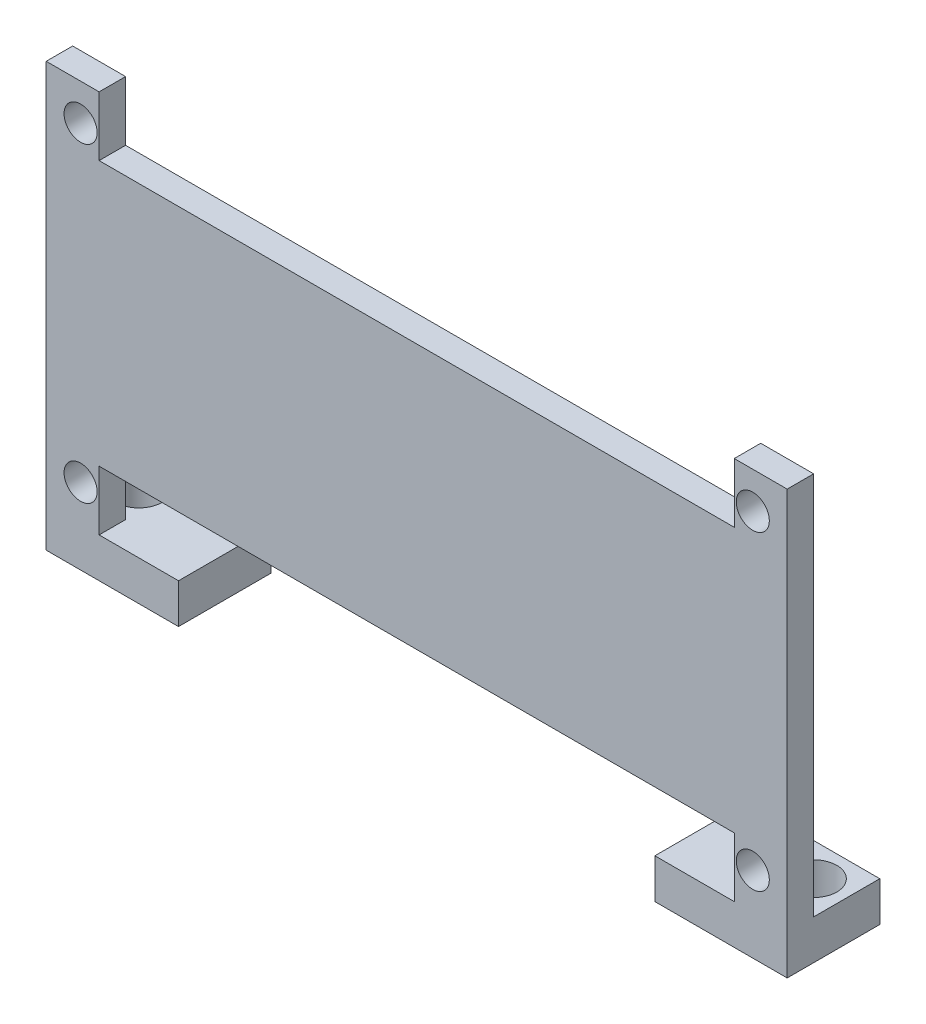
ISO-10303-21;
HEADER;
FILE_DESCRIPTION(('STEP AP214'),'2;1');
FILE_NAME('part.step','',(''),(''),'','','');
FILE_SCHEMA(('AUTOMOTIVE_DESIGN { 1 0 10303 214 1 1 1 1 }'));
ENDSEC;
DATA;
#1=APPLICATION_CONTEXT('core data for automotive mechanical design processes');
#2=APPLICATION_PROTOCOL_DEFINITION('international standard','automotive_design',2000,#1);
#3=PRODUCT_CONTEXT('',#1,'mechanical');
#4=PRODUCT('Part','Part','',(#3));
#5=PRODUCT_RELATED_PRODUCT_CATEGORY('part','',(#4));
#6=PRODUCT_DEFINITION_FORMATION('','',#4);
#7=PRODUCT_DEFINITION_CONTEXT('part definition',#1,'design');
#8=PRODUCT_DEFINITION('design','',#6,#7);
#9=PRODUCT_DEFINITION_SHAPE('','',#8);
#10=(LENGTH_UNIT() NAMED_UNIT(*) SI_UNIT(.MILLI.,.METRE.));
#11=(NAMED_UNIT(*) PLANE_ANGLE_UNIT() SI_UNIT($,.RADIAN.));
#12=(NAMED_UNIT(*) SI_UNIT($,.STERADIAN.) SOLID_ANGLE_UNIT());
#13=UNCERTAINTY_MEASURE_WITH_UNIT(LENGTH_MEASURE(1.E-05),#10,'distance_accuracy_value','');
#14=(GEOMETRIC_REPRESENTATION_CONTEXT(3) GLOBAL_UNCERTAINTY_ASSIGNED_CONTEXT((#13)) GLOBAL_UNIT_ASSIGNED_CONTEXT((#10,
#11,#12)) REPRESENTATION_CONTEXT('',''));
#15=CARTESIAN_POINT('',(0.,0.,0.));
#16=DIRECTION('',(0.,0.,1.));
#17=DIRECTION('',(1.,0.,0.));
#18=AXIS2_PLACEMENT_3D('',#15,#16,#17);
#19=CARTESIAN_POINT('',(-9.9656815453731,0.,2.));
#20=DIRECTION('',(1.,0.,0.));
#21=DIRECTION('',(0.,1.,0.));
#22=AXIS2_PLACEMENT_3D('',#19,#20,#21);
#23=PLANE('',#22);
#24=DIRECTION('',(0.,-1.,0.));
#25=VECTOR('',#24,1.);
#26=CARTESIAN_POINT('',(-9.9656815453731,0.,0.));
#27=LINE('',#26,#25);
#28=CARTESIAN_POINT('',(-9.96568154537309,-7.38239538892357,0.));
#29=VERTEX_POINT('',#28);
#30=CARTESIAN_POINT('',(-9.96568154537308,-11.8823953889236,0.));
#31=VERTEX_POINT('',#30);
#32=EDGE_CURVE('E186',#29,#31,#27,.T.);
#33=ORIENTED_EDGE('',*,*,#32,.F.);
#34=DIRECTION('',(0.,0.,-1.));
#35=VECTOR('',#34,1.);
#36=CARTESIAN_POINT('',(-9.96568154537309,-7.38239538892357,2.));
#37=LINE('',#36,#35);
#38=CARTESIAN_POINT('',(-9.96568154537309,-7.38239538892357,2.));
#39=VERTEX_POINT('',#38);
#40=EDGE_CURVE('E51',#39,#29,#37,.T.);
#41=ORIENTED_EDGE('',*,*,#40,.F.);
#42=DIRECTION('',(0.,-1.,0.));
#43=VECTOR('',#42,1.);
#44=CARTESIAN_POINT('',(-9.9656815453731,0.,2.));
#45=LINE('',#44,#43);
#46=CARTESIAN_POINT('',(-9.96568154537308,-11.8823953889236,2.));
#47=VERTEX_POINT('',#46);
#48=EDGE_CURVE('E365',#39,#47,#45,.T.);
#49=ORIENTED_EDGE('',*,*,#48,.T.);
#50=DIRECTION('',(0.,0.,-1.));
#51=VECTOR('',#50,1.);
#52=CARTESIAN_POINT('',(-9.96568154537308,-11.8823953889236,2.));
#53=LINE('',#52,#51);
#54=EDGE_CURVE('E11',#47,#31,#53,.T.);
#55=ORIENTED_EDGE('',*,*,#54,.T.);
#56=EDGE_LOOP('',(#33,#41,#49,#55));
#57=FACE_BOUND('',#56,.T.);
#58=ADVANCED_FACE('F40',(#57),#23,.T.);
#59=CARTESIAN_POINT('',(0.,-7.38239538892357,2.));
#60=DIRECTION('',(0.,1.,0.));
#61=DIRECTION('',(0.,0.,1.));
#62=AXIS2_PLACEMENT_3D('',#59,#60,#61);
#63=PLANE('',#62);
#64=DIRECTION('',(1.,0.,0.));
#65=VECTOR('',#64,1.);
#66=CARTESIAN_POINT('',(0.,-7.38239538892357,0.));
#67=LINE('',#66,#65);
#68=CARTESIAN_POINT('',(38.0343184546269,-7.38239538892357,0.));
#69=VERTEX_POINT('',#68);
#70=EDGE_CURVE('E190',#29,#69,#67,.T.);
#71=ORIENTED_EDGE('',*,*,#70,.T.);
#72=DIRECTION('',(0.,0.,-1.));
#73=VECTOR('',#72,1.);
#74=CARTESIAN_POINT('',(38.0343184546269,-7.38239538892357,2.));
#75=LINE('',#74,#73);
#76=CARTESIAN_POINT('',(38.0343184546269,-7.38239538892357,2.));
#77=VERTEX_POINT('',#76);
#78=EDGE_CURVE('E242',#77,#69,#75,.T.);
#79=ORIENTED_EDGE('',*,*,#78,.F.);
#80=DIRECTION('',(1.,0.,0.));
#81=VECTOR('',#80,1.);
#82=CARTESIAN_POINT('',(0.,-7.38239538892357,2.));
#83=LINE('',#82,#81);
#84=EDGE_CURVE('E368',#39,#77,#83,.T.);
#85=ORIENTED_EDGE('',*,*,#84,.F.);
#86=ORIENTED_EDGE('',*,*,#40,.T.);
#87=EDGE_LOOP('',(#71,#79,#85,#86));
#88=FACE_BOUND('',#87,.T.);
#89=ADVANCED_FACE('F423',(#88),#63,.F.);
#90=CARTESIAN_POINT('',(38.0343184546269,0.,2.));
#91=DIRECTION('',(1.,0.,0.));
#92=DIRECTION('',(0.,0.,-1.));
#93=AXIS2_PLACEMENT_3D('',#90,#91,#92);
#94=PLANE('',#93);
#95=DIRECTION('',(0.,-1.,0.));
#96=VECTOR('',#95,1.);
#97=CARTESIAN_POINT('',(38.0343184546269,0.,0.));
#98=LINE('',#97,#96);
#99=CARTESIAN_POINT('',(38.0343184546269,-11.8823953889236,0.));
#100=VERTEX_POINT('',#99);
#101=EDGE_CURVE('E194',#69,#100,#98,.T.);
#102=ORIENTED_EDGE('',*,*,#101,.T.);
#103=DIRECTION('',(0.,0.,-1.));
#104=VECTOR('',#103,1.);
#105=CARTESIAN_POINT('',(38.0343184546269,-11.8823953889236,2.));
#106=LINE('',#105,#104);
#107=CARTESIAN_POINT('',(38.0343184546269,-11.8823953889236,2.));
#108=VERTEX_POINT('',#107);
#109=EDGE_CURVE('E239',#108,#100,#106,.T.);
#110=ORIENTED_EDGE('',*,*,#109,.F.);
#111=DIRECTION('',(0.,-1.,0.));
#112=VECTOR('',#111,1.);
#113=CARTESIAN_POINT('',(38.0343184546269,0.,2.));
#114=LINE('',#113,#112);
#115=EDGE_CURVE('E372',#77,#108,#114,.T.);
#116=ORIENTED_EDGE('',*,*,#115,.F.);
#117=ORIENTED_EDGE('',*,*,#78,.T.);
#118=EDGE_LOOP('',(#102,#110,#116,#117));
#119=FACE_BOUND('',#118,.T.);
#120=ADVANCED_FACE('F431',(#119),#94,.F.);
#121=CARTESIAN_POINT('',(42.0343184546269,0.,2.));
#122=DIRECTION('',(-1.,0.,0.));
#123=DIRECTION('',(0.,0.,1.));
#124=AXIS2_PLACEMENT_3D('',#121,#122,#123);
#125=PLANE('',#124);
#126=DIRECTION('',(0.,1.,0.));
#127=VECTOR('',#126,1.);
#128=CARTESIAN_POINT('',(42.0343184546269,0.,0.));
#129=LINE('',#128,#127);
#130=CARTESIAN_POINT('',(42.0343184546269,-11.8823953889236,0.));
#131=VERTEX_POINT('',#130);
#132=CARTESIAN_POINT('',(42.0343184546269,17.1176046110764,0.));
#133=VERTEX_POINT('',#132);
#134=EDGE_CURVE('E202',#131,#133,#129,.T.);
#135=ORIENTED_EDGE('',*,*,#134,.T.);
#136=DIRECTION('',(0.,0.,-1.));
#137=VECTOR('',#136,1.);
#138=CARTESIAN_POINT('',(42.0343184546269,17.1176046110764,2.));
#139=LINE('',#138,#137);
#140=CARTESIAN_POINT('',(42.0343184546269,17.1176046110764,2.));
#141=VERTEX_POINT('',#140);
#142=EDGE_CURVE('E236',#141,#133,#139,.T.);
#143=ORIENTED_EDGE('',*,*,#142,.F.);
#144=DIRECTION('',(0.,1.,0.));
#145=VECTOR('',#144,1.);
#146=CARTESIAN_POINT('',(42.0343184546269,0.,2.));
#147=LINE('',#146,#145);
#148=CARTESIAN_POINT('',(42.0343184546269,-14.8823953889236,2.));
#149=VERTEX_POINT('',#148);
#150=EDGE_CURVE('E376',#149,#141,#147,.T.);
#151=ORIENTED_EDGE('',*,*,#150,.F.);
#152=DIRECTION('',(0.,0.,1.));
#153=VECTOR('',#152,1.);
#154=CARTESIAN_POINT('',(42.0343184546269,-14.8823953889236,-5.));
#155=LINE('',#154,#153);
#156=CARTESIAN_POINT('',(42.0343184546269,-14.8823953889236,-5.));
#157=VERTEX_POINT('',#156);
#158=EDGE_CURVE('E283',#157,#149,#155,.T.);
#159=ORIENTED_EDGE('',*,*,#158,.F.);
#160=DIRECTION('',(0.,1.,0.));
#161=VECTOR('',#160,1.);
#162=CARTESIAN_POINT('',(42.0343184546269,-11.8823953889236,-5.));
#163=LINE('',#162,#161);
#164=CARTESIAN_POINT('',(42.0343184546269,-11.8823953889236,-5.));
#165=VERTEX_POINT('',#164);
#166=EDGE_CURVE('E270',#157,#165,#163,.T.);
#167=ORIENTED_EDGE('',*,*,#166,.T.);
#168=DIRECTION('',(0.,0.,1.));
#169=VECTOR('',#168,1.);
#170=CARTESIAN_POINT('',(42.0343184546269,-11.8823953889236,-5.));
#171=LINE('',#170,#169);
#172=EDGE_CURVE('E303',#165,#131,#171,.T.);
#173=ORIENTED_EDGE('',*,*,#172,.T.);
#174=EDGE_LOOP('',(#135,#143,#151,#159,#167,#173));
#175=FACE_BOUND('',#174,.T.);
#176=ADVANCED_FACE('F536',(#175),#125,.F.);
#177=CARTESIAN_POINT('',(0.,17.1176046110764,2.));
#178=DIRECTION('',(0.,1.,0.));
#179=DIRECTION('',(0.,0.,1.));
#180=AXIS2_PLACEMENT_3D('',#177,#178,#179);
#181=PLANE('',#180);
#182=DIRECTION('',(1.,0.,0.));
#183=VECTOR('',#182,1.);
#184=CARTESIAN_POINT('',(0.,17.1176046110764,0.));
#185=LINE('',#184,#183);
#186=CARTESIAN_POINT('',(38.0343184546269,17.1176046110764,0.));
#187=VERTEX_POINT('',#186);
#188=EDGE_CURVE('E206',#187,#133,#185,.T.);
#189=ORIENTED_EDGE('',*,*,#188,.F.);
#190=DIRECTION('',(0.,0.,-1.));
#191=VECTOR('',#190,1.);
#192=CARTESIAN_POINT('',(38.0343184546269,17.1176046110764,2.));
#193=LINE('',#192,#191);
#194=CARTESIAN_POINT('',(38.0343184546269,17.1176046110764,2.));
#195=VERTEX_POINT('',#194);
#196=EDGE_CURVE('E233',#195,#187,#193,.T.);
#197=ORIENTED_EDGE('',*,*,#196,.F.);
#198=DIRECTION('',(1.,0.,0.));
#199=VECTOR('',#198,1.);
#200=CARTESIAN_POINT('',(0.,17.1176046110764,2.));
#201=LINE('',#200,#199);
#202=EDGE_CURVE('E157',#195,#141,#201,.T.);
#203=ORIENTED_EDGE('',*,*,#202,.T.);
#204=ORIENTED_EDGE('',*,*,#142,.T.);
#205=EDGE_LOOP('',(#189,#197,#203,#204));
#206=FACE_BOUND('',#205,.T.);
#207=ADVANCED_FACE('F382',(#206),#181,.T.);
#208=CARTESIAN_POINT('',(38.0343184546269,0.,2.));
#209=DIRECTION('',(-1.,0.,0.));
#210=DIRECTION('',(0.,-1.,0.));
#211=AXIS2_PLACEMENT_3D('',#208,#209,#210);
#212=PLANE('',#211);
#213=DIRECTION('',(0.,1.,0.));
#214=VECTOR('',#213,1.);
#215=CARTESIAN_POINT('',(38.0343184546269,0.,0.));
#216=LINE('',#215,#214);
#217=CARTESIAN_POINT('',(38.0343184546269,12.6176046110764,0.));
#218=VERTEX_POINT('',#217);
#219=EDGE_CURVE('E210',#218,#187,#216,.T.);
#220=ORIENTED_EDGE('',*,*,#219,.F.);
#221=DIRECTION('',(0.,0.,-1.));
#222=VECTOR('',#221,1.);
#223=CARTESIAN_POINT('',(38.0343184546269,12.6176046110764,2.));
#224=LINE('',#223,#222);
#225=CARTESIAN_POINT('',(38.0343184546269,12.6176046110764,2.));
#226=VERTEX_POINT('',#225);
#227=EDGE_CURVE('E137',#226,#218,#224,.T.);
#228=ORIENTED_EDGE('',*,*,#227,.F.);
#229=DIRECTION('',(0.,1.,0.));
#230=VECTOR('',#229,1.);
#231=CARTESIAN_POINT('',(38.0343184546269,0.,2.));
#232=LINE('',#231,#230);
#233=EDGE_CURVE('E153',#226,#195,#232,.T.);
#234=ORIENTED_EDGE('',*,*,#233,.T.);
#235=ORIENTED_EDGE('',*,*,#196,.T.);
#236=EDGE_LOOP('',(#220,#228,#234,#235));
#237=FACE_BOUND('',#236,.T.);
#238=ADVANCED_FACE('F387',(#237),#212,.T.);
#239=CARTESIAN_POINT('',(0.,12.6176046110764,2.));
#240=DIRECTION('',(0.,1.,0.));
#241=DIRECTION('',(0.,0.,1.));
#242=AXIS2_PLACEMENT_3D('',#239,#240,#241);
#243=PLANE('',#242);
#244=DIRECTION('',(1.,0.,0.));
#245=VECTOR('',#244,1.);
#246=CARTESIAN_POINT('',(0.,12.6176046110764,0.));
#247=LINE('',#246,#245);
#248=CARTESIAN_POINT('',(-9.96568154537309,12.6176046110764,0.));
#249=VERTEX_POINT('',#248);
#250=EDGE_CURVE('E132',#249,#218,#247,.T.);
#251=ORIENTED_EDGE('',*,*,#250,.F.);
#252=DIRECTION('',(0.,0.,-1.));
#253=VECTOR('',#252,1.);
#254=CARTESIAN_POINT('',(-9.96568154537309,12.6176046110764,2.));
#255=LINE('',#254,#253);
#256=CARTESIAN_POINT('',(-9.96568154537309,12.6176046110764,2.));
#257=VERTEX_POINT('',#256);
#258=EDGE_CURVE('E126',#257,#249,#255,.T.);
#259=ORIENTED_EDGE('',*,*,#258,.F.);
#260=DIRECTION('',(1.,0.,0.));
#261=VECTOR('',#260,1.);
#262=CARTESIAN_POINT('',(0.,12.6176046110764,2.));
#263=LINE('',#262,#261);
#264=EDGE_CURVE('E130',#257,#226,#263,.T.);
#265=ORIENTED_EDGE('',*,*,#264,.T.);
#266=ORIENTED_EDGE('',*,*,#227,.T.);
#267=EDGE_LOOP('',(#251,#259,#265,#266));
#268=FACE_BOUND('',#267,.T.);
#269=ADVANCED_FACE('F128',(#268),#243,.T.);
#270=CARTESIAN_POINT('',(-9.96568154537309,0.,2.));
#271=DIRECTION('',(-1.,0.,0.));
#272=DIRECTION('',(0.,0.,1.));
#273=AXIS2_PLACEMENT_3D('',#270,#271,#272);
#274=PLANE('',#273);
#275=DIRECTION('',(0.,1.,0.));
#276=VECTOR('',#275,1.);
#277=CARTESIAN_POINT('',(-9.96568154537309,0.,0.));
#278=LINE('',#277,#276);
#279=CARTESIAN_POINT('',(-9.96568154537309,17.1176046110764,0.));
#280=VERTEX_POINT('',#279);
#281=EDGE_CURVE('E216',#249,#280,#278,.T.);
#282=ORIENTED_EDGE('',*,*,#281,.T.);
#283=DIRECTION('',(0.,0.,-1.));
#284=VECTOR('',#283,1.);
#285=CARTESIAN_POINT('',(-9.96568154537309,17.1176046110764,2.));
#286=LINE('',#285,#284);
#287=CARTESIAN_POINT('',(-9.96568154537309,17.1176046110764,2.));
#288=VERTEX_POINT('',#287);
#289=EDGE_CURVE('E138',#288,#280,#286,.T.);
#290=ORIENTED_EDGE('',*,*,#289,.F.);
#291=DIRECTION('',(0.,1.,0.));
#292=VECTOR('',#291,1.);
#293=CARTESIAN_POINT('',(-9.96568154537309,0.,2.));
#294=LINE('',#293,#292);
#295=EDGE_CURVE('E141',#257,#288,#294,.T.);
#296=ORIENTED_EDGE('',*,*,#295,.F.);
#297=ORIENTED_EDGE('',*,*,#258,.T.);
#298=EDGE_LOOP('',(#282,#290,#296,#297));
#299=FACE_BOUND('',#298,.T.);
#300=ADVANCED_FACE('F142',(#299),#274,.F.);
#301=CARTESIAN_POINT('',(0.,17.1176046110764,2.));
#302=DIRECTION('',(0.,1.,0.));
#303=DIRECTION('',(0.,0.,1.));
#304=AXIS2_PLACEMENT_3D('',#301,#302,#303);
#305=PLANE('',#304);
#306=DIRECTION('',(1.,0.,0.));
#307=VECTOR('',#306,1.);
#308=CARTESIAN_POINT('',(0.,17.1176046110764,0.));
#309=LINE('',#308,#307);
#310=CARTESIAN_POINT('',(-13.9656815453731,17.1176046110764,0.));
#311=VERTEX_POINT('',#310);
#312=EDGE_CURVE('E219',#311,#280,#309,.T.);
#313=ORIENTED_EDGE('',*,*,#312,.F.);
#314=DIRECTION('',(0.,0.,-1.));
#315=VECTOR('',#314,1.);
#316=CARTESIAN_POINT('',(-13.9656815453731,17.1176046110764,2.));
#317=LINE('',#316,#315);
#318=CARTESIAN_POINT('',(-13.9656815453731,17.1176046110764,2.));
#319=VERTEX_POINT('',#318);
#320=EDGE_CURVE('E60',#319,#311,#317,.T.);
#321=ORIENTED_EDGE('',*,*,#320,.F.);
#322=DIRECTION('',(1.,0.,0.));
#323=VECTOR('',#322,1.);
#324=CARTESIAN_POINT('',(0.,17.1176046110764,2.));
#325=LINE('',#324,#323);
#326=EDGE_CURVE('E146',#319,#288,#325,.T.);
#327=ORIENTED_EDGE('',*,*,#326,.T.);
#328=ORIENTED_EDGE('',*,*,#289,.T.);
#329=EDGE_LOOP('',(#313,#321,#327,#328));
#330=FACE_BOUND('',#329,.T.);
#331=ADVANCED_FACE('F390',(#330),#305,.T.);
#332=CARTESIAN_POINT('',(-11.3656815453731,14.3676046110764,2.));
#333=DIRECTION('',(0.,0.,-1.));
#334=DIRECTION('',(-1.,0.,0.));
#335=AXIS2_PLACEMENT_3D('',#332,#333,#334);
#336=CYLINDRICAL_SURFACE('',#335,1.25);
#337=CARTESIAN_POINT('',(-11.3656815453731,14.3676046110764,2.));
#338=DIRECTION('',(0.,0.,1.));
#339=DIRECTION('',(1.,0.,0.));
#340=AXIS2_PLACEMENT_3D('',#337,#338,#339);
#341=CIRCLE('',#340,1.25);
#342=CARTESIAN_POINT('',(-10.1156815453731,14.3676046110764,2.));
#343=VERTEX_POINT('',#342);
#344=EDGE_CURVE('E361',#343,#343,#341,.T.);
#345=ORIENTED_EDGE('',*,*,#344,.T.);
#346=EDGE_LOOP('',(#345));
#347=FACE_BOUND('',#346,.T.);
#348=CARTESIAN_POINT('',(-11.3656815453731,14.3676046110764,0.));
#349=DIRECTION('',(0.,0.,1.));
#350=DIRECTION('',(1.,0.,0.));
#351=AXIS2_PLACEMENT_3D('',#348,#349,#350);
#352=CIRCLE('',#351,1.25);
#353=CARTESIAN_POINT('',(-10.1156815453731,14.3676046110764,0.));
#354=VERTEX_POINT('',#353);
#355=EDGE_CURVE('E178',#354,#354,#352,.T.);
#356=ORIENTED_EDGE('',*,*,#355,.F.);
#357=EDGE_LOOP('',(#356));
#358=FACE_BOUND('',#357,.T.);
#359=ADVANCED_FACE('F487',(#347,#358),#336,.F.);
#360=CARTESIAN_POINT('',(-11.3656815453731,-9.13239538892358,2.));
#361=DIRECTION('',(0.,0.,-1.));
#362=DIRECTION('',(-1.,0.,0.));
#363=AXIS2_PLACEMENT_3D('',#360,#361,#362);
#364=CYLINDRICAL_SURFACE('',#363,1.25);
#365=CARTESIAN_POINT('',(-11.3656815453731,-9.13239538892358,2.));
#366=DIRECTION('',(0.,0.,1.));
#367=DIRECTION('',(1.,0.,0.));
#368=AXIS2_PLACEMENT_3D('',#365,#366,#367);
#369=CIRCLE('',#368,1.25);
#370=CARTESIAN_POINT('',(-10.1156815453731,-9.13239538892358,2.));
#371=VERTEX_POINT('',#370);
#372=EDGE_CURVE('E357',#371,#371,#369,.T.);
#373=ORIENTED_EDGE('',*,*,#372,.T.);
#374=EDGE_LOOP('',(#373));
#375=FACE_BOUND('',#374,.T.);
#376=CARTESIAN_POINT('',(-11.3656815453731,-9.13239538892358,0.));
#377=DIRECTION('',(0.,0.,1.));
#378=DIRECTION('',(1.,0.,0.));
#379=AXIS2_PLACEMENT_3D('',#376,#377,#378);
#380=CIRCLE('',#379,1.25);
#381=CARTESIAN_POINT('',(-10.1156815453731,-9.13239538892358,0.));
#382=VERTEX_POINT('',#381);
#383=EDGE_CURVE('E174',#382,#382,#380,.T.);
#384=ORIENTED_EDGE('',*,*,#383,.F.);
#385=EDGE_LOOP('',(#384));
#386=FACE_BOUND('',#385,.T.);
#387=ADVANCED_FACE('F490',(#375,#386),#364,.F.);
#388=CARTESIAN_POINT('',(39.4343184546269,-9.13239538892357,2.));
#389=DIRECTION('',(0.,0.,-1.));
#390=DIRECTION('',(-1.,0.,0.));
#391=AXIS2_PLACEMENT_3D('',#388,#389,#390);
#392=CYLINDRICAL_SURFACE('',#391,1.25000000000001);
#393=CARTESIAN_POINT('',(39.4343184546269,-9.13239538892357,2.));
#394=DIRECTION('',(0.,0.,1.));
#395=DIRECTION('',(1.,0.,0.));
#396=AXIS2_PLACEMENT_3D('',#393,#394,#395);
#397=CIRCLE('',#396,1.25000000000001);
#398=CARTESIAN_POINT('',(40.6843184546269,-9.13239538892357,2.));
#399=VERTEX_POINT('',#398);
#400=EDGE_CURVE('E353',#399,#399,#397,.T.);
#401=ORIENTED_EDGE('',*,*,#400,.T.);
#402=EDGE_LOOP('',(#401));
#403=FACE_BOUND('',#402,.T.);
#404=CARTESIAN_POINT('',(39.4343184546269,-9.13239538892357,0.));
#405=DIRECTION('',(0.,0.,1.));
#406=DIRECTION('',(1.,0.,0.));
#407=AXIS2_PLACEMENT_3D('',#404,#405,#406);
#408=CIRCLE('',#407,1.25000000000001);
#409=CARTESIAN_POINT('',(40.6843184546269,-9.13239538892357,0.));
#410=VERTEX_POINT('',#409);
#411=EDGE_CURVE('E170',#410,#410,#408,.T.);
#412=ORIENTED_EDGE('',*,*,#411,.F.);
#413=EDGE_LOOP('',(#412));
#414=FACE_BOUND('',#413,.T.);
#415=ADVANCED_FACE('F493',(#403,#414),#392,.F.);
#416=CARTESIAN_POINT('',(39.4343184546269,14.3676046110764,2.));
#417=DIRECTION('',(0.,0.,-1.));
#418=DIRECTION('',(-1.,0.,0.));
#419=AXIS2_PLACEMENT_3D('',#416,#417,#418);
#420=CYLINDRICAL_SURFACE('',#419,1.25);
#421=CARTESIAN_POINT('',(39.4343184546269,14.3676046110764,2.));
#422=DIRECTION('',(0.,0.,1.));
#423=DIRECTION('',(1.,0.,0.));
#424=AXIS2_PLACEMENT_3D('',#421,#422,#423);
#425=CIRCLE('',#424,1.25);
#426=CARTESIAN_POINT('',(40.6843184546269,14.3676046110764,2.));
#427=VERTEX_POINT('',#426);
#428=EDGE_CURVE('E226',#427,#427,#425,.T.);
#429=ORIENTED_EDGE('',*,*,#428,.T.);
#430=EDGE_LOOP('',(#429));
#431=FACE_BOUND('',#430,.T.);
#432=CARTESIAN_POINT('',(39.4343184546269,14.3676046110764,0.));
#433=DIRECTION('',(0.,0.,1.));
#434=DIRECTION('',(1.,0.,0.));
#435=AXIS2_PLACEMENT_3D('',#432,#433,#434);
#436=CIRCLE('',#435,1.25);
#437=CARTESIAN_POINT('',(40.6843184546269,14.3676046110764,0.));
#438=VERTEX_POINT('',#437);
#439=EDGE_CURVE('E166',#438,#438,#436,.T.);
#440=ORIENTED_EDGE('',*,*,#439,.F.);
#441=EDGE_LOOP('',(#440));
#442=FACE_BOUND('',#441,.T.);
#443=ADVANCED_FACE('F42',(#431,#442),#420,.F.);
#444=CARTESIAN_POINT('',(-13.9656815453731,0.,2.));
#445=DIRECTION('',(1.,0.,0.));
#446=DIRECTION('',(0.,1.,0.));
#447=AXIS2_PLACEMENT_3D('',#444,#445,#446);
#448=PLANE('',#447);
#449=DIRECTION('',(0.,-1.,0.));
#450=VECTOR('',#449,1.);
#451=CARTESIAN_POINT('',(-13.9656815453731,0.,0.));
#452=LINE('',#451,#450);
#453=CARTESIAN_POINT('',(-13.9656815453731,-11.8823953889236,0.));
#454=VERTEX_POINT('',#453);
#455=EDGE_CURVE('E223',#311,#454,#452,.T.);
#456=ORIENTED_EDGE('',*,*,#455,.T.);
#457=DIRECTION('',(0.,0.,1.));
#458=VECTOR('',#457,1.);
#459=CARTESIAN_POINT('',(-13.9656815453731,-11.8823953889236,-5.));
#460=LINE('',#459,#458);
#461=CARTESIAN_POINT('',(-13.9656815453731,-11.8823953889236,-5.));
#462=VERTEX_POINT('',#461);
#463=EDGE_CURVE('E101',#462,#454,#460,.T.);
#464=ORIENTED_EDGE('',*,*,#463,.F.);
#465=DIRECTION('',(0.,-1.,0.));
#466=VECTOR('',#465,1.);
#467=CARTESIAN_POINT('',(-13.9656815453731,-11.8823953889236,-5.));
#468=LINE('',#467,#466);
#469=CARTESIAN_POINT('',(-13.9656815453731,-14.8823953889236,-5.));
#470=VERTEX_POINT('',#469);
#471=EDGE_CURVE('E310',#462,#470,#468,.T.);
#472=ORIENTED_EDGE('',*,*,#471,.T.);
#473=DIRECTION('',(0.,0.,1.));
#474=VECTOR('',#473,1.);
#475=CARTESIAN_POINT('',(-13.9656815453731,-14.8823953889236,-5.));
#476=LINE('',#475,#474);
#477=CARTESIAN_POINT('',(-13.9656815453731,-14.8823953889236,2.));
#478=VERTEX_POINT('',#477);
#479=EDGE_CURVE('E326',#470,#478,#476,.T.);
#480=ORIENTED_EDGE('',*,*,#479,.T.);
#481=DIRECTION('',(0.,-1.,0.));
#482=VECTOR('',#481,1.);
#483=CARTESIAN_POINT('',(-13.9656815453731,0.,2.));
#484=LINE('',#483,#482);
#485=EDGE_CURVE('E163',#319,#478,#484,.T.);
#486=ORIENTED_EDGE('',*,*,#485,.F.);
#487=ORIENTED_EDGE('',*,*,#320,.T.);
#488=EDGE_LOOP('',(#456,#464,#472,#480,#486,#487));
#489=FACE_BOUND('',#488,.T.);
#490=ADVANCED_FACE('F397',(#489),#448,.F.);
#491=CARTESIAN_POINT('',(0.,0.,2.));
#492=DIRECTION('',(0.,0.,1.));
#493=DIRECTION('',(1.,0.,0.));
#494=AXIS2_PLACEMENT_3D('',#491,#492,#493);
#495=PLANE('',#494);
#496=ORIENTED_EDGE('',*,*,#428,.F.);
#497=EDGE_LOOP('',(#496));
#498=FACE_BOUND('',#497,.T.);
#499=ORIENTED_EDGE('',*,*,#400,.F.);
#500=EDGE_LOOP('',(#499));
#501=FACE_BOUND('',#500,.T.);
#502=ORIENTED_EDGE('',*,*,#372,.F.);
#503=EDGE_LOOP('',(#502));
#504=FACE_BOUND('',#503,.T.);
#505=ORIENTED_EDGE('',*,*,#344,.F.);
#506=EDGE_LOOP('',(#505));
#507=FACE_BOUND('',#506,.T.);
#508=ORIENTED_EDGE('',*,*,#485,.T.);
#509=DIRECTION('',(1.,0.,0.));
#510=VECTOR('',#509,1.);
#511=CARTESIAN_POINT('',(-13.9656815453731,-14.8823953889236,2.));
#512=LINE('',#511,#510);
#513=CARTESIAN_POINT('',(-3.96568154537309,-14.8823953889236,2.));
#514=VERTEX_POINT('',#513);
#515=EDGE_CURVE('E298',#478,#514,#512,.T.);
#516=ORIENTED_EDGE('',*,*,#515,.T.);
#517=DIRECTION('',(0.,1.,0.));
#518=VECTOR('',#517,1.);
#519=CARTESIAN_POINT('',(-3.96568154537309,-11.8823953889236,2.));
#520=LINE('',#519,#518);
#521=CARTESIAN_POINT('',(-3.96568154537309,-11.8823953889236,2.));
#522=VERTEX_POINT('',#521);
#523=EDGE_CURVE('E330',#514,#522,#520,.T.);
#524=ORIENTED_EDGE('',*,*,#523,.T.);
#525=DIRECTION('',(-1.,0.,0.));
#526=VECTOR('',#525,1.);
#527=CARTESIAN_POINT('',(-13.9656815453731,-11.8823953889236,2.));
#528=LINE('',#527,#526);
#529=EDGE_CURVE('E315',#522,#47,#528,.T.);
#530=ORIENTED_EDGE('',*,*,#529,.T.);
#531=ORIENTED_EDGE('',*,*,#48,.F.);
#532=ORIENTED_EDGE('',*,*,#84,.T.);
#533=ORIENTED_EDGE('',*,*,#115,.T.);
#534=DIRECTION('',(-1.,0.,0.));
#535=VECTOR('',#534,1.);
#536=CARTESIAN_POINT('',(32.0343184546269,-11.8823953889236,2.));
#537=LINE('',#536,#535);
#538=CARTESIAN_POINT('',(32.0343184546269,-11.8823953889236,2.));
#539=VERTEX_POINT('',#538);
#540=EDGE_CURVE('E287',#108,#539,#537,.T.);
#541=ORIENTED_EDGE('',*,*,#540,.T.);
#542=DIRECTION('',(0.,-1.,0.));
#543=VECTOR('',#542,1.);
#544=CARTESIAN_POINT('',(32.0343184546269,-14.8823953889236,2.));
#545=LINE('',#544,#543);
#546=CARTESIAN_POINT('',(32.0343184546269,-14.8823953889236,2.));
#547=VERTEX_POINT('',#546);
#548=EDGE_CURVE('E271',#539,#547,#545,.T.);
#549=ORIENTED_EDGE('',*,*,#548,.T.);
#550=DIRECTION('',(1.,0.,0.));
#551=VECTOR('',#550,1.);
#552=CARTESIAN_POINT('',(32.0343184546269,-14.8823953889236,2.));
#553=LINE('',#552,#551);
#554=EDGE_CURVE('E256',#547,#149,#553,.T.);
#555=ORIENTED_EDGE('',*,*,#554,.T.);
#556=ORIENTED_EDGE('',*,*,#150,.T.);
#557=ORIENTED_EDGE('',*,*,#202,.F.);
#558=ORIENTED_EDGE('',*,*,#233,.F.);
#559=ORIENTED_EDGE('',*,*,#264,.F.);
#560=ORIENTED_EDGE('',*,*,#295,.T.);
#561=ORIENTED_EDGE('',*,*,#326,.F.);
#562=EDGE_LOOP('',(#508,#516,#524,#530,#531,#532,#533,#541,#549,#555,#556,#557,#558,#559,#560,#561));
#563=FACE_BOUND('',#562,.T.);
#564=ADVANCED_FACE('F150',(#498,#501,#504,#507,#563),#495,.T.);
#565=CARTESIAN_POINT('',(0.,0.,0.));
#566=DIRECTION('',(0.,0.,1.));
#567=DIRECTION('',(1.,0.,0.));
#568=AXIS2_PLACEMENT_3D('',#565,#566,#567);
#569=PLANE('',#568);
#570=ORIENTED_EDGE('',*,*,#439,.T.);
#571=EDGE_LOOP('',(#570));
#572=FACE_BOUND('',#571,.T.);
#573=ORIENTED_EDGE('',*,*,#411,.T.);
#574=EDGE_LOOP('',(#573));
#575=FACE_BOUND('',#574,.T.);
#576=ORIENTED_EDGE('',*,*,#383,.T.);
#577=EDGE_LOOP('',(#576));
#578=FACE_BOUND('',#577,.T.);
#579=ORIENTED_EDGE('',*,*,#355,.T.);
#580=EDGE_LOOP('',(#579));
#581=FACE_BOUND('',#580,.T.);
#582=DIRECTION('',(-1.,0.,0.));
#583=VECTOR('',#582,1.);
#584=CARTESIAN_POINT('',(0.,-11.8823953889236,0.));
#585=LINE('',#584,#583);
#586=EDGE_CURVE('E182',#31,#454,#585,.T.);
#587=ORIENTED_EDGE('',*,*,#586,.T.);
#588=ORIENTED_EDGE('',*,*,#455,.F.);
#589=ORIENTED_EDGE('',*,*,#312,.T.);
#590=ORIENTED_EDGE('',*,*,#281,.F.);
#591=ORIENTED_EDGE('',*,*,#250,.T.);
#592=ORIENTED_EDGE('',*,*,#219,.T.);
#593=ORIENTED_EDGE('',*,*,#188,.T.);
#594=ORIENTED_EDGE('',*,*,#134,.F.);
#595=DIRECTION('',(-1.,0.,0.));
#596=VECTOR('',#595,1.);
#597=CARTESIAN_POINT('',(0.,-11.8823953889236,0.));
#598=LINE('',#597,#596);
#599=EDGE_CURVE('E198',#131,#100,#598,.T.);
#600=ORIENTED_EDGE('',*,*,#599,.T.);
#601=ORIENTED_EDGE('',*,*,#101,.F.);
#602=ORIENTED_EDGE('',*,*,#70,.F.);
#603=ORIENTED_EDGE('',*,*,#32,.T.);
#604=EDGE_LOOP('',(#587,#588,#589,#590,#591,#592,#593,#594,#600,#601,#602,#603));
#605=FACE_BOUND('',#604,.T.);
#606=ADVANCED_FACE('F389',(#572,#575,#578,#581,#605),#569,.F.);
#607=CARTESIAN_POINT('',(-13.9656815453731,-11.8823953889236,-5.));
#608=DIRECTION('',(0.,1.,0.));
#609=DIRECTION('',(0.,0.,1.));
#610=AXIS2_PLACEMENT_3D('',#607,#608,#609);
#611=PLANE('',#610);
#612=CARTESIAN_POINT('',(-11.4656815453731,-11.8823953889236,-2.5));
#613=DIRECTION('',(0.,1.,0.));
#614=DIRECTION('',(0.,0.,1.));
#615=AXIS2_PLACEMENT_3D('',#612,#613,#614);
#616=CIRCLE('',#615,1.75);
#617=CARTESIAN_POINT('',(-11.4656815453731,-11.8823953889236,-0.75));
#618=VERTEX_POINT('',#617);
#619=EDGE_CURVE('E250',#618,#618,#616,.T.);
#620=ORIENTED_EDGE('',*,*,#619,.F.);
#621=EDGE_LOOP('',(#620));
#622=FACE_BOUND('',#621,.T.);
#623=ORIENTED_EDGE('',*,*,#586,.F.);
#624=ORIENTED_EDGE('',*,*,#54,.F.);
#625=ORIENTED_EDGE('',*,*,#529,.F.);
#626=DIRECTION('',(0.,0.,1.));
#627=VECTOR('',#626,1.);
#628=CARTESIAN_POINT('',(-3.96568154537309,-11.8823953889236,-5.));
#629=LINE('',#628,#627);
#630=CARTESIAN_POINT('',(-3.96568154537309,-11.8823953889236,-5.));
#631=VERTEX_POINT('',#630);
#632=EDGE_CURVE('E339',#631,#522,#629,.T.);
#633=ORIENTED_EDGE('',*,*,#632,.F.);
#634=DIRECTION('',(-1.,0.,0.));
#635=VECTOR('',#634,1.);
#636=CARTESIAN_POINT('',(-13.9656815453731,-11.8823953889236,-5.));
#637=LINE('',#636,#635);
#638=EDGE_CURVE('E323',#631,#462,#637,.T.);
#639=ORIENTED_EDGE('',*,*,#638,.T.);
#640=ORIENTED_EDGE('',*,*,#463,.T.);
#641=EDGE_LOOP('',(#623,#624,#625,#633,#639,#640));
#642=FACE_BOUND('',#641,.T.);
#643=ADVANCED_FACE('F417',(#622,#642),#611,.T.);
#644=CARTESIAN_POINT('',(-3.96568154537309,-11.8823953889236,-5.));
#645=DIRECTION('',(1.,0.,0.));
#646=DIRECTION('',(0.,0.,-1.));
#647=AXIS2_PLACEMENT_3D('',#644,#645,#646);
#648=PLANE('',#647);
#649=ORIENTED_EDGE('',*,*,#523,.F.);
#650=DIRECTION('',(0.,0.,1.));
#651=VECTOR('',#650,1.);
#652=CARTESIAN_POINT('',(-3.96568154537309,-14.8823953889236,-5.));
#653=LINE('',#652,#651);
#654=CARTESIAN_POINT('',(-3.96568154537309,-14.8823953889236,-5.));
#655=VERTEX_POINT('',#654);
#656=EDGE_CURVE('E343',#655,#514,#653,.T.);
#657=ORIENTED_EDGE('',*,*,#656,.F.);
#658=DIRECTION('',(0.,1.,0.));
#659=VECTOR('',#658,1.);
#660=CARTESIAN_POINT('',(-3.96568154537309,-11.8823953889236,-5.));
#661=LINE('',#660,#659);
#662=EDGE_CURVE('E319',#655,#631,#661,.T.);
#663=ORIENTED_EDGE('',*,*,#662,.T.);
#664=ORIENTED_EDGE('',*,*,#632,.T.);
#665=EDGE_LOOP('',(#649,#657,#663,#664));
#666=FACE_BOUND('',#665,.T.);
#667=ADVANCED_FACE('F410',(#666),#648,.T.);
#668=CARTESIAN_POINT('',(-13.9656815453731,-14.8823953889236,-5.));
#669=DIRECTION('',(0.,-1.,0.));
#670=DIRECTION('',(0.,0.,-1.));
#671=AXIS2_PLACEMENT_3D('',#668,#669,#670);
#672=PLANE('',#671);
#673=CARTESIAN_POINT('',(-11.4656815453731,-14.8823953889236,-2.5));
#674=DIRECTION('',(0.,-1.,0.));
#675=DIRECTION('',(0.,0.,-1.));
#676=AXIS2_PLACEMENT_3D('',#673,#674,#675);
#677=CIRCLE('',#676,1.75);
#678=CARTESIAN_POINT('',(-11.4656815453731,-14.8823953889236,-4.25));
#679=VERTEX_POINT('',#678);
#680=EDGE_CURVE('E44',#679,#679,#677,.T.);
#681=ORIENTED_EDGE('',*,*,#680,.F.);
#682=EDGE_LOOP('',(#681));
#683=FACE_BOUND('',#682,.T.);
#684=ORIENTED_EDGE('',*,*,#515,.F.);
#685=ORIENTED_EDGE('',*,*,#479,.F.);
#686=DIRECTION('',(1.,0.,0.));
#687=VECTOR('',#686,1.);
#688=CARTESIAN_POINT('',(-13.9656815453731,-14.8823953889236,-5.));
#689=LINE('',#688,#687);
#690=EDGE_CURVE('E314',#470,#655,#689,.T.);
#691=ORIENTED_EDGE('',*,*,#690,.T.);
#692=ORIENTED_EDGE('',*,*,#656,.T.);
#693=EDGE_LOOP('',(#684,#685,#691,#692));
#694=FACE_BOUND('',#693,.T.);
#695=ADVANCED_FACE('F402',(#683,#694),#672,.T.);
#696=CARTESIAN_POINT('',(0.,0.,-5.));
#697=DIRECTION('',(0.,0.,1.));
#698=DIRECTION('',(1.,0.,0.));
#699=AXIS2_PLACEMENT_3D('',#696,#697,#698);
#700=PLANE('',#699);
#701=ORIENTED_EDGE('',*,*,#471,.F.);
#702=ORIENTED_EDGE('',*,*,#638,.F.);
#703=ORIENTED_EDGE('',*,*,#662,.F.);
#704=ORIENTED_EDGE('',*,*,#690,.F.);
#705=EDGE_LOOP('',(#701,#702,#703,#704));
#706=FACE_BOUND('',#705,.T.);
#707=ADVANCED_FACE('F461',(#706),#700,.F.);
#708=CARTESIAN_POINT('',(32.0343184546269,-11.8823953889236,-5.));
#709=DIRECTION('',(0.,1.,0.));
#710=DIRECTION('',(0.,0.,1.));
#711=AXIS2_PLACEMENT_3D('',#708,#709,#710);
#712=PLANE('',#711);
#713=CARTESIAN_POINT('',(39.5343184546269,-11.8823953889236,-2.5));
#714=DIRECTION('',(0.,1.,0.));
#715=DIRECTION('',(0.,0.,1.));
#716=AXIS2_PLACEMENT_3D('',#713,#714,#715);
#717=CIRCLE('',#716,1.75);
#718=CARTESIAN_POINT('',(39.5343184546269,-11.8823953889236,-0.749999999999997));
#719=VERTEX_POINT('',#718);
#720=EDGE_CURVE('E258',#719,#719,#717,.T.);
#721=ORIENTED_EDGE('',*,*,#720,.F.);
#722=EDGE_LOOP('',(#721));
#723=FACE_BOUND('',#722,.T.);
#724=ORIENTED_EDGE('',*,*,#109,.T.);
#725=ORIENTED_EDGE('',*,*,#599,.F.);
#726=ORIENTED_EDGE('',*,*,#172,.F.);
#727=DIRECTION('',(-1.,0.,0.));
#728=VECTOR('',#727,1.);
#729=CARTESIAN_POINT('',(32.0343184546269,-11.8823953889236,-5.));
#730=LINE('',#729,#728);
#731=CARTESIAN_POINT('',(32.0343184546269,-11.8823953889236,-5.));
#732=VERTEX_POINT('',#731);
#733=EDGE_CURVE('E275',#165,#732,#730,.T.);
#734=ORIENTED_EDGE('',*,*,#733,.T.);
#735=DIRECTION('',(0.,0.,1.));
#736=VECTOR('',#735,1.);
#737=CARTESIAN_POINT('',(32.0343184546269,-11.8823953889236,-5.));
#738=LINE('',#737,#736);
#739=EDGE_CURVE('E299',#732,#539,#738,.T.);
#740=ORIENTED_EDGE('',*,*,#739,.T.);
#741=ORIENTED_EDGE('',*,*,#540,.F.);
#742=EDGE_LOOP('',(#724,#725,#726,#734,#740,#741));
#743=FACE_BOUND('',#742,.T.);
#744=ADVANCED_FACE('F434',(#723,#743),#712,.T.);
#745=CARTESIAN_POINT('',(32.0343184546269,-14.8823953889236,-5.));
#746=DIRECTION('',(0.,-1.,0.));
#747=DIRECTION('',(0.,0.,-1.));
#748=AXIS2_PLACEMENT_3D('',#745,#746,#747);
#749=PLANE('',#748);
#750=CARTESIAN_POINT('',(39.5343184546269,-14.8823953889236,-2.5));
#751=DIRECTION('',(0.,-1.,0.));
#752=DIRECTION('',(0.,0.,-1.));
#753=AXIS2_PLACEMENT_3D('',#750,#751,#752);
#754=CIRCLE('',#753,1.75);
#755=CARTESIAN_POINT('',(39.5343184546269,-14.8823953889236,-4.25));
#756=VERTEX_POINT('',#755);
#757=EDGE_CURVE('E247',#756,#756,#754,.T.);
#758=ORIENTED_EDGE('',*,*,#757,.F.);
#759=EDGE_LOOP('',(#758));
#760=FACE_BOUND('',#759,.T.);
#761=ORIENTED_EDGE('',*,*,#554,.F.);
#762=DIRECTION('',(0.,0.,1.));
#763=VECTOR('',#762,1.);
#764=CARTESIAN_POINT('',(32.0343184546269,-14.8823953889236,-5.));
#765=LINE('',#764,#763);
#766=CARTESIAN_POINT('',(32.0343184546269,-14.8823953889236,-5.));
#767=VERTEX_POINT('',#766);
#768=EDGE_CURVE('E294',#767,#547,#765,.T.);
#769=ORIENTED_EDGE('',*,*,#768,.F.);
#770=DIRECTION('',(1.,0.,0.));
#771=VECTOR('',#770,1.);
#772=CARTESIAN_POINT('',(32.0343184546269,-14.8823953889236,-5.));
#773=LINE('',#772,#771);
#774=EDGE_CURVE('E266',#767,#157,#773,.T.);
#775=ORIENTED_EDGE('',*,*,#774,.T.);
#776=ORIENTED_EDGE('',*,*,#158,.T.);
#777=EDGE_LOOP('',(#761,#769,#775,#776));
#778=FACE_BOUND('',#777,.T.);
#779=ADVANCED_FACE('F469',(#760,#778),#749,.T.);
#780=CARTESIAN_POINT('',(32.0343184546269,-14.8823953889236,-5.));
#781=DIRECTION('',(-1.,0.,0.));
#782=DIRECTION('',(0.,0.,1.));
#783=AXIS2_PLACEMENT_3D('',#780,#781,#782);
#784=PLANE('',#783);
#785=ORIENTED_EDGE('',*,*,#548,.F.);
#786=ORIENTED_EDGE('',*,*,#739,.F.);
#787=DIRECTION('',(0.,-1.,0.));
#788=VECTOR('',#787,1.);
#789=CARTESIAN_POINT('',(32.0343184546269,-14.8823953889236,-5.));
#790=LINE('',#789,#788);
#791=EDGE_CURVE('E279',#732,#767,#790,.T.);
#792=ORIENTED_EDGE('',*,*,#791,.T.);
#793=ORIENTED_EDGE('',*,*,#768,.T.);
#794=EDGE_LOOP('',(#785,#786,#792,#793));
#795=FACE_BOUND('',#794,.T.);
#796=ADVANCED_FACE('F445',(#795),#784,.T.);
#797=CARTESIAN_POINT('',(0.,0.,-5.));
#798=DIRECTION('',(0.,0.,-1.));
#799=DIRECTION('',(-1.,0.,0.));
#800=AXIS2_PLACEMENT_3D('',#797,#798,#799);
#801=PLANE('',#800);
#802=ORIENTED_EDGE('',*,*,#774,.F.);
#803=ORIENTED_EDGE('',*,*,#791,.F.);
#804=ORIENTED_EDGE('',*,*,#733,.F.);
#805=ORIENTED_EDGE('',*,*,#166,.F.);
#806=EDGE_LOOP('',(#802,#803,#804,#805));
#807=FACE_BOUND('',#806,.T.);
#808=ADVANCED_FACE('F599',(#807),#801,.T.);
#809=CARTESIAN_POINT('',(39.5343184546269,-16.8823953889236,-2.5));
#810=DIRECTION('',(0.,1.,0.));
#811=DIRECTION('',(0.,0.,1.));
#812=AXIS2_PLACEMENT_3D('',#809,#810,#811);
#813=CYLINDRICAL_SURFACE('',#812,1.75);
#814=ORIENTED_EDGE('',*,*,#757,.T.);
#815=EDGE_LOOP('',(#814));
#816=FACE_BOUND('',#815,.T.);
#817=ORIENTED_EDGE('',*,*,#720,.T.);
#818=EDGE_LOOP('',(#817));
#819=FACE_BOUND('',#818,.T.);
#820=ADVANCED_FACE('F593',(#816,#819),#813,.F.);
#821=CARTESIAN_POINT('',(-11.4656815453731,-16.8823953889236,-2.5));
#822=DIRECTION('',(0.,1.,0.));
#823=DIRECTION('',(0.,0.,1.));
#824=AXIS2_PLACEMENT_3D('',#821,#822,#823);
#825=CYLINDRICAL_SURFACE('',#824,1.75);
#826=ORIENTED_EDGE('',*,*,#680,.T.);
#827=EDGE_LOOP('',(#826));
#828=FACE_BOUND('',#827,.T.);
#829=ORIENTED_EDGE('',*,*,#619,.T.);
#830=EDGE_LOOP('',(#829));
#831=FACE_BOUND('',#830,.T.);
#832=ADVANCED_FACE('F598',(#828,#831),#825,.F.);
#833=CLOSED_SHELL('',(#58,#89,#120,#176,#207,#238,#269,#300,#331,#359,#387,#415,#443,#490,#564,
#606,#643,#667,#695,#707,#744,#779,#796,#808,#820,#832));
#834=MANIFOLD_SOLID_BREP('B2',#833);
#835=ADVANCED_BREP_SHAPE_REPRESENTATION('',(#18,#834),#14);
#836=SHAPE_DEFINITION_REPRESENTATION(#9,#835);
ENDSEC;
END-ISO-10303-21;
